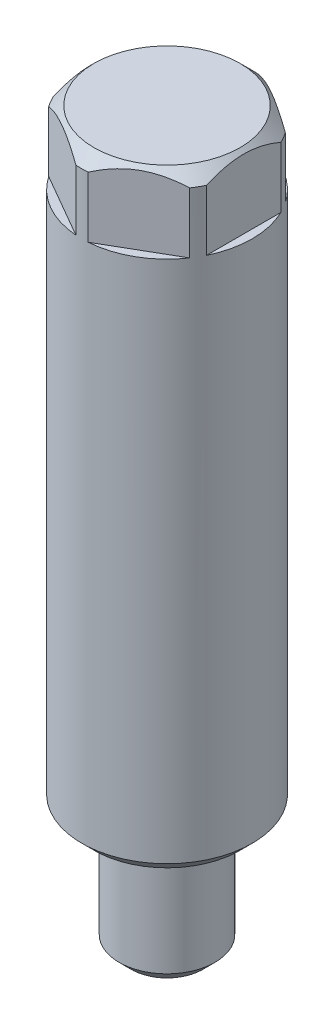
ISO-10303-21;
HEADER;
FILE_DESCRIPTION(('STEP AP214'),'2;1');
FILE_NAME('part.step','',(''),(''),'','','');
FILE_SCHEMA(('AUTOMOTIVE_DESIGN { 1 0 10303 214 1 1 1 1 }'));
ENDSEC;
DATA;
#1=APPLICATION_CONTEXT('core data for automotive mechanical design processes');
#2=APPLICATION_PROTOCOL_DEFINITION('international standard','automotive_design',2000,#1);
#3=PRODUCT_CONTEXT('',#1,'mechanical');
#4=PRODUCT('Part','Part','',(#3));
#5=PRODUCT_RELATED_PRODUCT_CATEGORY('part','',(#4));
#6=PRODUCT_DEFINITION_FORMATION('','',#4);
#7=PRODUCT_DEFINITION_CONTEXT('part definition',#1,'design');
#8=PRODUCT_DEFINITION('design','',#6,#7);
#9=PRODUCT_DEFINITION_SHAPE('','',#8);
#10=(LENGTH_UNIT() NAMED_UNIT(*) SI_UNIT(.MILLI.,.METRE.));
#11=(NAMED_UNIT(*) PLANE_ANGLE_UNIT() SI_UNIT($,.RADIAN.));
#12=(NAMED_UNIT(*) SI_UNIT($,.STERADIAN.) SOLID_ANGLE_UNIT());
#13=UNCERTAINTY_MEASURE_WITH_UNIT(LENGTH_MEASURE(1.E-05),#10,'distance_accuracy_value','');
#14=(GEOMETRIC_REPRESENTATION_CONTEXT(3) GLOBAL_UNCERTAINTY_ASSIGNED_CONTEXT((#13)) GLOBAL_UNIT_ASSIGNED_CONTEXT((#10,
#11,#12)) REPRESENTATION_CONTEXT('',''));
#15=CARTESIAN_POINT('',(0.,0.,0.));
#16=DIRECTION('',(0.,0.,1.));
#17=DIRECTION('',(1.,0.,0.));
#18=AXIS2_PLACEMENT_3D('',#15,#16,#17);
#19=CARTESIAN_POINT('',(0.,0.,0.));
#20=DIRECTION('',(0.,-1.,0.));
#21=DIRECTION('',(0.,0.,-1.));
#22=AXIS2_PLACEMENT_3D('',#19,#20,#21);
#23=CYLINDRICAL_SURFACE('',#22,4.445);
#24=CARTESIAN_POINT('',(-1.11022302462516E-13,6.98499999999991,0.));
#25=DIRECTION('',(0.,-1.,0.));
#26=DIRECTION('',(0.,0.,-1.));
#27=AXIS2_PLACEMENT_3D('',#24,#25,#26);
#28=CIRCLE('',#27,4.445);
#29=CARTESIAN_POINT('',(-1.07814590588617E-13,6.9849999999999,-4.44500000000006));
#30=VERTEX_POINT('',#29);
#31=EDGE_CURVE('E363',#30,#30,#28,.F.);
#32=ORIENTED_EDGE('',*,*,#31,.T.);
#33=EDGE_LOOP('',(#32));
#34=FACE_BOUND('',#33,.T.);
#35=CARTESIAN_POINT('',(-1.66533453693773E-13,34.3,-5.55111512312578E-13));
#36=DIRECTION('',(0.,1.,0.));
#37=DIRECTION('',(0.,0.,1.));
#38=AXIS2_PLACEMENT_3D('',#35,#36,#37);
#39=CIRCLE('',#38,4.445);
#40=CARTESIAN_POINT('',(-0.321155531325224,34.3,4.43338292105389));
#41=VERTEX_POINT('',#40);
#42=CARTESIAN_POINT('',(-3.67884446867528,34.3,2.49482030922016));
#43=VERTEX_POINT('',#42);
#44=EDGE_CURVE('E12',#41,#43,#39,.F.);
#45=ORIENTED_EDGE('',*,*,#44,.T.);
#46=DIRECTION('',(0.,-1.,0.));
#47=VECTOR('',#46,1.);
#48=CARTESIAN_POINT('',(-3.67884446867523,0.,2.49482030922038));
#49=LINE('',#48,#47);
#50=CARTESIAN_POINT('',(-3.67884446867539,37.465,2.49482030922022));
#51=VERTEX_POINT('',#50);
#52=EDGE_CURVE('E214',#43,#51,#49,.F.);
#53=ORIENTED_EDGE('',*,*,#52,.T.);
#54=CARTESIAN_POINT('',(-3.33066907387547E-13,37.465,-3.33066907387547E-13));
#55=DIRECTION('',(0.,1.,0.));
#56=DIRECTION('',(0.,0.,1.));
#57=AXIS2_PLACEMENT_3D('',#54,#55,#56);
#58=CIRCLE('',#57,4.445);
#59=CARTESIAN_POINT('',(-3.9999999999999,37.465,1.93856261183284));
#60=VERTEX_POINT('',#59);
#61=EDGE_CURVE('E301',#51,#60,#58,.F.);
#62=ORIENTED_EDGE('',*,*,#61,.T.);
#63=DIRECTION('',(0.,-1.,0.));
#64=VECTOR('',#63,1.);
#65=CARTESIAN_POINT('',(-4.00000000000017,0.,1.93856261183329));
#66=LINE('',#65,#64);
#67=CARTESIAN_POINT('',(-3.99999999999995,34.3,1.93856261183301));
#68=VERTEX_POINT('',#67);
#69=EDGE_CURVE('E293',#60,#68,#66,.T.);
#70=ORIENTED_EDGE('',*,*,#69,.T.);
#71=CARTESIAN_POINT('',(-3.99999999999973,34.3,-1.93856261183445));
#72=VERTEX_POINT('',#71);
#73=EDGE_CURVE('E28',#68,#72,#39,.F.);
#74=ORIENTED_EDGE('',*,*,#73,.T.);
#75=DIRECTION('',(0.,-1.,0.));
#76=VECTOR('',#75,1.);
#77=CARTESIAN_POINT('',(-3.99999999999984,0.,-1.9385626118345));
#78=LINE('',#77,#76);
#79=CARTESIAN_POINT('',(-4.00000000000039,37.465,-1.93856261183522));
#80=VERTEX_POINT('',#79);
#81=EDGE_CURVE('E295',#72,#80,#78,.F.);
#82=ORIENTED_EDGE('',*,*,#81,.T.);
#83=CARTESIAN_POINT('',(-3.678844468675,37.465,-2.49482030922143));
#84=VERTEX_POINT('',#83);
#85=EDGE_CURVE('E350',#80,#84,#58,.F.);
#86=ORIENTED_EDGE('',*,*,#85,.T.);
#87=DIRECTION('',(0.,-1.,0.));
#88=VECTOR('',#87,1.);
#89=CARTESIAN_POINT('',(-3.67884446867517,0.,-2.49482030922193));
#90=LINE('',#89,#88);
#91=CARTESIAN_POINT('',(-3.67884446867511,34.3,-2.49482030922193));
#92=VERTEX_POINT('',#91);
#93=EDGE_CURVE('E309',#84,#92,#90,.T.);
#94=ORIENTED_EDGE('',*,*,#93,.T.);
#95=CARTESIAN_POINT('',(-0.321155531325334,34.3,-4.43338292105478));
#96=VERTEX_POINT('',#95);
#97=EDGE_CURVE('E348',#92,#96,#39,.F.);
#98=ORIENTED_EDGE('',*,*,#97,.T.);
#99=DIRECTION('',(0.,-1.,0.));
#100=VECTOR('',#99,1.);
#101=CARTESIAN_POINT('',(-0.321155531325001,0.,-4.43338292105505));
#102=LINE('',#101,#100);
#103=CARTESIAN_POINT('',(-0.321155531325556,37.465,-4.43338292105494));
#104=VERTEX_POINT('',#103);
#105=EDGE_CURVE('E303',#96,#104,#102,.F.);
#106=ORIENTED_EDGE('',*,*,#105,.T.);
#107=CARTESIAN_POINT('',(0.321155531325001,37.465,-4.43338292105555));
#108=VERTEX_POINT('',#107);
#109=EDGE_CURVE('E355',#104,#108,#58,.F.);
#110=ORIENTED_EDGE('',*,*,#109,.T.);
#111=DIRECTION('',(0.,-1.,0.));
#112=VECTOR('',#111,1.);
#113=CARTESIAN_POINT('',(0.321155531324946,0.,-4.43338292105572));
#114=LINE('',#113,#112);
#115=CARTESIAN_POINT('',(0.321155531325112,34.3,-4.43338292105566));
#116=VERTEX_POINT('',#115);
#117=EDGE_CURVE('E332',#108,#116,#114,.T.);
#118=ORIENTED_EDGE('',*,*,#117,.T.);
#119=CARTESIAN_POINT('',(3.67884446867451,34.3,-2.49482030922138));
#120=VERTEX_POINT('',#119);
#121=EDGE_CURVE('E134',#116,#120,#39,.F.);
#122=ORIENTED_EDGE('',*,*,#121,.T.);
#123=DIRECTION('',(0.,-1.,0.));
#124=VECTOR('',#123,1.);
#125=CARTESIAN_POINT('',(3.67884446867467,0.,-2.49482030922105));
#126=LINE('',#125,#124);
#127=CARTESIAN_POINT('',(3.67884446867456,37.465,-2.49482030922099));
#128=VERTEX_POINT('',#127);
#129=EDGE_CURVE('E336',#120,#128,#126,.F.);
#130=ORIENTED_EDGE('',*,*,#129,.T.);
#131=CARTESIAN_POINT('',(3.99999999999961,37.465,-1.9385626118344));
#132=VERTEX_POINT('',#131);
#133=EDGE_CURVE('E371',#128,#132,#58,.F.);
#134=ORIENTED_EDGE('',*,*,#133,.T.);
#135=DIRECTION('',(0.,-1.,0.));
#136=VECTOR('',#135,1.);
#137=CARTESIAN_POINT('',(4.00000000000012,0.,-1.93856261183467));
#138=LINE('',#137,#136);
#139=CARTESIAN_POINT('',(3.99999999999973,34.3,-1.93856261183434));
#140=VERTEX_POINT('',#139);
#141=EDGE_CURVE('E43',#132,#140,#138,.T.);
#142=ORIENTED_EDGE('',*,*,#141,.T.);
#143=CARTESIAN_POINT('',(3.99999999999995,34.3,1.93856261183367));
#144=VERTEX_POINT('',#143);
#145=EDGE_CURVE('E128',#140,#144,#39,.F.);
#146=ORIENTED_EDGE('',*,*,#145,.T.);
#147=DIRECTION('',(0.,-1.,0.));
#148=VECTOR('',#147,1.);
#149=CARTESIAN_POINT('',(4.00000000000017,0.,1.93856261183306));
#150=LINE('',#149,#148);
#151=CARTESIAN_POINT('',(4.00000000000017,37.465,1.93856261183289));
#152=VERTEX_POINT('',#151);
#153=EDGE_CURVE('E328',#144,#152,#150,.F.);
#154=ORIENTED_EDGE('',*,*,#153,.T.);
#155=CARTESIAN_POINT('',(3.67884446867467,37.465,2.49482030922044));
#156=VERTEX_POINT('',#155);
#157=EDGE_CURVE('E374',#152,#156,#58,.F.);
#158=ORIENTED_EDGE('',*,*,#157,.T.);
#159=DIRECTION('',(0.,-1.,0.));
#160=VECTOR('',#159,1.);
#161=CARTESIAN_POINT('',(3.67884446867444,0.,2.49482030922016));
#162=LINE('',#161,#160);
#163=CARTESIAN_POINT('',(3.67884446867439,34.3,2.49482030922044));
#164=VERTEX_POINT('',#163);
#165=EDGE_CURVE('E35',#156,#164,#162,.T.);
#166=ORIENTED_EDGE('',*,*,#165,.T.);
#167=CARTESIAN_POINT('',(0.321155531325057,34.3,4.43338292105433));
#168=VERTEX_POINT('',#167);
#169=EDGE_CURVE('E23',#164,#168,#39,.F.);
#170=ORIENTED_EDGE('',*,*,#169,.T.);
#171=DIRECTION('',(0.,-1.,0.));
#172=VECTOR('',#171,1.);
#173=CARTESIAN_POINT('',(0.321155531325168,0.,4.43338292105411));
#174=LINE('',#173,#172);
#175=CARTESIAN_POINT('',(0.321155531324946,37.465,4.43338292105422));
#176=VERTEX_POINT('',#175);
#177=EDGE_CURVE('E109',#168,#176,#174,.F.);
#178=ORIENTED_EDGE('',*,*,#177,.T.);
#179=CARTESIAN_POINT('',(-0.321155531325723,37.465,4.43338292105427));
#180=VERTEX_POINT('',#179);
#181=EDGE_CURVE('E314',#176,#180,#58,.F.);
#182=ORIENTED_EDGE('',*,*,#181,.T.);
#183=DIRECTION('',(0.,-1.,0.));
#184=VECTOR('',#183,1.);
#185=CARTESIAN_POINT('',(-0.321155531325001,0.,4.43338292105389));
#186=LINE('',#185,#184);
#187=EDGE_CURVE('E221',#180,#41,#186,.T.);
#188=ORIENTED_EDGE('',*,*,#187,.T.);
#189=EDGE_LOOP('',(#45,#53,#62,#70,#74,#82,#86,#94,#98,#106,#110,#118,#122,#130,#134,#142,#146,
#154,#158,#166,#170,#178,#182,#188));
#190=FACE_BOUND('',#189,.T.);
#191=ADVANCED_FACE('F19',(#34,#190),#23,.T.);
#192=CARTESIAN_POINT('',(-3.33066907387547E-13,37.465,-3.33066907387547E-13));
#193=DIRECTION('',(0.,-1.,0.));
#194=DIRECTION('',(0.,0.,-1.));
#195=AXIS2_PLACEMENT_3D('',#192,#193,#194);
#196=CONICAL_SURFACE('',#195,4.445,0.785398163397445);
#197=CARTESIAN_POINT('',(-2.77555756156289E-13,38.1,-6.10622663543836E-13));
#198=DIRECTION('',(0.,1.,0.));
#199=DIRECTION('',(0.,0.,1.));
#200=AXIS2_PLACEMENT_3D('',#197,#198,#199);
#201=CIRCLE('',#200,3.81);
#202=CARTESIAN_POINT('',(-2.80305223476773E-13,38.1,3.80999999999939));
#203=VERTEX_POINT('',#202);
#204=EDGE_CURVE('E360',#203,#203,#201,.T.);
#205=ORIENTED_EDGE('',*,*,#204,.F.);
#206=EDGE_LOOP('',(#205));
#207=FACE_BOUND('',#206,.T.);
#208=ORIENTED_EDGE('',*,*,#61,.F.);
#209=CARTESIAN_POINT('',(-3.67924157880906,37.4648,2.49459103757748));
#210=CARTESIAN_POINT('',(-3.55842668008898,37.5256475819524,2.56434355187511));
#211=CARTESIAN_POINT('',(-3.43577687510053,37.5821161939123,2.63515544980108));
#212=CARTESIAN_POINT('',(-3.18661058206892,37.6839828819882,2.77901167615578));
#213=CARTESIAN_POINT('',(-3.0600818676109,37.7293407721551,2.85206306350842));
#214=CARTESIAN_POINT('',(-2.80525749768695,37.8057743284289,2.99918598208));
#215=CARTESIAN_POINT('',(-2.67699738347415,37.8370039187697,3.07323699354689));
#216=CARTESIAN_POINT('',(-2.41847964602117,37.8836076436892,3.22249227885608));
#217=CARTESIAN_POINT('',(-2.28822526184028,37.8990051879054,3.29769468262663));
#218=CARTESIAN_POINT('',(-2.03526080562799,37.9122848524362,3.44374377951615));
#219=CARTESIAN_POINT('',(-1.91259198073002,37.9112085566851,3.5145666585916));
#220=CARTESIAN_POINT('',(-1.66798704258085,37.8941453545516,3.65578938547678));
#221=CARTESIAN_POINT('',(-1.54605133144097,37.8781509045181,3.72618900112743));
#222=CARTESIAN_POINT('',(-1.30421211468979,37.8324394041874,3.86581493801925));
#223=CARTESIAN_POINT('',(-1.18430791647583,37.8027271324349,3.93504165913475));
#224=CARTESIAN_POINT('',(-0.947174486107135,37.7314328980728,4.07195070899265));
#225=CARTESIAN_POINT('',(-0.829946095289468,37.6898472562366,4.13963255198886));
#226=CARTESIAN_POINT('',(-0.647561004669942,37.6165664014648,4.2449326331538));
#227=CARTESIAN_POINT('',(-0.581391396404496,37.588148727599,4.28313567429746));
#228=CARTESIAN_POINT('',(-0.450242196575703,37.5285033306455,4.35885470012198));
#229=CARTESIAN_POINT('',(-0.385259568943978,37.497284526477,4.39637243767773));
#230=CARTESIAN_POINT('',(-0.32075842119128,37.4648,4.43361219269661));
#231=B_SPLINE_CURVE_WITH_KNOTS('',3,(#209,#210,#211,#212,#213,#214,#215,#216,#217,#218,#219,
#220,#221,#222,#223,#224,#225,#226,#227,#228,#229,#230),.UNSPECIFIED.,.F.,.F.,(4,2,2,2,2,2,2,2,
2,2,4),(0.,0.456806526364886,0.915241640320476,1.36855427044122,1.82119565368307,
2.24534314890753,2.66970523880162,3.09391961537831,3.51826558710297,3.76277283649077,
4.0065274633879),.UNSPECIFIED.);
#232=EDGE_CURVE('E129',#51,#180,#231,.T.);
#233=ORIENTED_EDGE('',*,*,#232,.T.);
#234=ORIENTED_EDGE('',*,*,#181,.F.);
#235=CARTESIAN_POINT('',(0.320758421190947,37.4648,4.43361219269672));
#236=CARTESIAN_POINT('',(0.441573319910949,37.5256475819519,4.36385967839879));
#237=CARTESIAN_POINT('',(0.564223124899364,37.5821161939118,4.29304778047272));
#238=CARTESIAN_POINT('',(0.813389417930992,37.6839828819876,4.14919155411795));
#239=CARTESIAN_POINT('',(0.939918132389067,37.7293407721545,4.07614016676534));
#240=CARTESIAN_POINT('',(1.1947425023131,37.8057743284282,3.92901724819365));
#241=CARTESIAN_POINT('',(1.32300261652594,37.8370039187689,3.85496623672664));
#242=CARTESIAN_POINT('',(1.58152035397909,37.8836076436887,3.70571095141762));
#243=CARTESIAN_POINT('',(1.71177473816012,37.8990051879054,3.63050854764737));
#244=CARTESIAN_POINT('',(1.96473919437235,37.9122848524361,3.48445945075785));
#245=CARTESIAN_POINT('',(2.08740801927012,37.9112085566844,3.41363657168215));
#246=CARTESIAN_POINT('',(2.33201295741919,37.8941453545505,3.2724138447968));
#247=CARTESIAN_POINT('',(2.45394866855917,37.8781509045172,3.20201422914623));
#248=CARTESIAN_POINT('',(2.69578788531027,37.8324394041864,3.06238829225439));
#249=CARTESIAN_POINT('',(2.81569208352406,37.8027271324336,2.99316157113877));
#250=CARTESIAN_POINT('',(3.05282551389312,37.7314328980721,2.85625252128117));
#251=CARTESIAN_POINT('',(3.17005390471131,37.6898472562369,2.78857067828537));
#252=CARTESIAN_POINT('',(3.35243899533039,37.6165664014647,2.68327059712037));
#253=CARTESIAN_POINT('',(3.41860860359535,37.5881487275984,2.64506755597656));
#254=CARTESIAN_POINT('',(3.54975780342355,37.5285033306445,2.56934853015194));
#255=CARTESIAN_POINT('',(3.61474043105516,37.497284526476,2.53183079259623));
#256=CARTESIAN_POINT('',(3.67924157880834,37.4648,2.49459103757776));
#257=B_SPLINE_CURVE_WITH_KNOTS('',3,(#235,#236,#237,#238,#239,#240,#241,#242,#243,#244,#245,
#246,#247,#248,#249,#250,#251,#252,#253,#254,#255,#256),.UNSPECIFIED.,.F.,.F.,(4,2,2,2,2,2,2,2,
2,2,4),(0.,0.456806526364733,0.915241640320467,1.36855427044142,1.82119565368331,
2.24534314890765,2.6697052388018,3.09391961537848,3.518265587103,3.76277283649034,
4.00652746338704),.UNSPECIFIED.);
#258=EDGE_CURVE('E113',#176,#156,#257,.T.);
#259=ORIENTED_EDGE('',*,*,#258,.T.);
#260=ORIENTED_EDGE('',*,*,#157,.F.);
#261=CARTESIAN_POINT('',(4.00000000000022,35.758130470376,-4.67391684880308));
#262=CARTESIAN_POINT('',(3.99999999999969,35.8443456942503,-4.56041354774168));
#263=CARTESIAN_POINT('',(3.99999999999947,35.9297476742269,-4.44628241733308));
#264=CARTESIAN_POINT('',(3.99999999999931,36.0985586174467,-4.21651392996503));
#265=CARTESIAN_POINT('',(3.99999999999937,36.1819670846352,-4.10087620895002));
#266=CARTESIAN_POINT('',(3.99999999999941,36.347017940246,-3.86699799772407));
#267=CARTESIAN_POINT('',(3.9999999999994,36.4286416611714,-3.74874428932665));
#268=CARTESIAN_POINT('',(3.99999999999939,36.5889105568525,-3.51024173377978));
#269=CARTESIAN_POINT('',(3.99999999999939,36.6675559401949,-3.3899930272006));
#270=CARTESIAN_POINT('',(3.99999999999939,36.8257435566655,-3.13999738692947));
#271=CARTESIAN_POINT('',(3.99999999999938,36.90506380849,-3.01010927777554));
#272=CARTESIAN_POINT('',(3.9999999999994,37.0585831176381,-2.74729429663522));
#273=CARTESIAN_POINT('',(3.99999999999943,37.1327813473136,-2.61436693814615));
#274=CARTESIAN_POINT('',(3.99999999999935,37.2744622234466,-2.3454701266144));
#275=CARTESIAN_POINT('',(3.99999999999925,37.3419646125748,-2.20951115799648));
#276=CARTESIAN_POINT('',(3.99999999999953,37.4687421642559,-1.93384067233958));
#277=CARTESIAN_POINT('',(3.99999999999992,37.5280211030445,-1.7941309130889));
#278=CARTESIAN_POINT('',(3.99999999999987,37.6315471815475,-1.52297748977935));
#279=CARTESIAN_POINT('',(3.99999999999951,37.6766510887059,-1.39186434054456));
#280=CARTESIAN_POINT('',(3.99999999999927,37.7563491126691,-1.12642190871188));
#281=CARTESIAN_POINT('',(3.9999999999994,37.7909425240761,-0.992092410905475));
#282=CARTESIAN_POINT('',(3.99999999999938,37.8472166619945,-0.723286768512063));
#283=CARTESIAN_POINT('',(3.99999999999925,37.8691228347054,-0.58885861069329));
#284=CARTESIAN_POINT('',(3.99999999999953,37.8995864837885,-0.318490080047614));
#285=CARTESIAN_POINT('',(3.99999999999996,37.9081463994936,-0.182549988136654));
#286=CARTESIAN_POINT('',(3.99999999999994,37.9112514158807,0.0842533899229561));
#287=CARTESIAN_POINT('',(3.99999999999953,37.9063232430706,0.215110698811373));
#288=CARTESIAN_POINT('',(3.99999999999925,37.8839027239278,0.475737347582689));
#289=CARTESIAN_POINT('',(3.99999999999938,37.8664091808294,0.605506582642864));
#290=CARTESIAN_POINT('',(3.9999999999994,37.8195259667422,0.865213175723362));
#291=CARTESIAN_POINT('',(3.99999999999928,37.7899314516751,0.995112947003596));
#292=CARTESIAN_POINT('',(3.99999999999949,37.7204448649146,1.25207324199553));
#293=CARTESIAN_POINT('',(3.99999999999982,37.6805535683695,1.37913397864959));
#294=CARTESIAN_POINT('',(3.99999999999985,37.5885693859732,1.64040097415722));
#295=CARTESIAN_POINT('',(3.99999999999951,37.5357480647939,1.77434805933812));
#296=CARTESIAN_POINT('',(3.99999999999926,37.4219773983793,2.03877532915735));
#297=CARTESIAN_POINT('',(3.99999999999936,37.3610243086421,2.16925388321785));
#298=CARTESIAN_POINT('',(3.99999999999942,37.232438483361,2.42737411792324));
#299=CARTESIAN_POINT('',(3.9999999999994,37.1647849090994,2.5550053330583));
#300=CARTESIAN_POINT('',(3.99999999999938,37.0242911743795,2.80733515288008));
#301=CARTESIAN_POINT('',(3.99999999999939,36.9514518295907,2.93203421467846));
#302=CARTESIAN_POINT('',(3.99999999999939,36.8053213801128,3.17276369559882));
#303=CARTESIAN_POINT('',(3.99999999999939,36.7322320216332,3.28891723103115));
#304=CARTESIAN_POINT('',(3.99999999999939,36.5829660547145,3.51922961347799));
#305=CARTESIAN_POINT('',(3.9999999999994,36.5067892132136,3.63338830897549));
#306=CARTESIAN_POINT('',(3.99999999999938,36.3525257325269,3.85904901804164));
#307=CARTESIAN_POINT('',(3.99999999999936,36.274459530761,3.97056505309079));
#308=CARTESIAN_POINT('',(3.99999999999942,36.116252366992,4.19207095310085));
#309=CARTESIAN_POINT('',(3.99999999999949,36.0361119820476,4.30206122973742));
#310=CARTESIAN_POINT('',(3.99999999999967,35.95512321585,4.41141219049029));
#311=B_SPLINE_CURVE_WITH_KNOTS('',3,(#261,#262,#263,#264,#265,#266,#267,#268,#269,#270,#271,
#272,#273,#274,#275,#276,#277,#278,#279,#280,#281,#282,#283,#284,#285,#286,#287,#288,#289,#290,
#291,#292,#293,#294,#295,#296,#297,#298,#299,#300,#301,#302,#303,#304,#305,#306,#307,#308,#309,
#310),.UNSPECIFIED.,.F.,.F.,(4,2,2,2,2,2,2,2,2,2,2,2,2,2,2,2,2,2,2,2,2,2,2,2,4),(0.,
0.427611554035311,0.855328427493845,1.28635600389762,1.71735333742733,2.17383757941247,
2.63039541112152,3.08556435896379,3.54052359489737,3.95612345897401,4.3717512093195,
4.7797469494646,5.18766811033748,5.57988906919655,5.97214738938067,6.37134044400533,
6.77050345587829,7.20212646898267,7.63394892552403,8.06715925730394,8.50030159935603,
8.91195204449802,9.32363362160571,9.73198449469129,10.1402229563502),.UNSPECIFIED.);
#312=EDGE_CURVE('E260',#152,#132,#311,.F.);
#313=ORIENTED_EDGE('',*,*,#312,.T.);
#314=ORIENTED_EDGE('',*,*,#133,.F.);
#315=CARTESIAN_POINT('',(3.6792415788085,37.4648,-2.4945910375786));
#316=CARTESIAN_POINT('',(3.55842668008854,37.5256475819517,-2.56434355187679));
#317=CARTESIAN_POINT('',(3.43577687510014,37.5821161939114,-2.63515544980293));
#318=CARTESIAN_POINT('',(3.18661058206848,37.6839828819872,-2.77901167615775));
#319=CARTESIAN_POINT('',(3.06008186761036,37.7293407721542,-2.85206306351035));
#320=CARTESIAN_POINT('',(2.80525749768632,37.8057743284278,-2.99918598208208));
#321=CARTESIAN_POINT('',(2.67699738347353,37.8370039187684,-3.07323699354916));
#322=CARTESIAN_POINT('',(2.41847964602033,37.8836076436885,-3.22249227885798));
#323=CARTESIAN_POINT('',(2.28822526183922,37.8990051879055,-3.29769468262796));
#324=CARTESIAN_POINT('',(2.03526080562709,37.9122848524362,-3.44374377951745));
#325=CARTESIAN_POINT('',(1.91259198072948,37.9112085566842,-3.51456665859337));
#326=CARTESIAN_POINT('',(1.66798704258053,37.8941453545501,-3.65578938547884));
#327=CARTESIAN_POINT('',(1.54605133144051,37.8781509045169,-3.72618900112932));
#328=CARTESIAN_POINT('',(1.30421211468943,37.8324394041861,-3.86581493802117));
#329=CARTESIAN_POINT('',(1.18430791647572,37.8027271324333,-3.93504165913687));
#330=CARTESIAN_POINT('',(0.947174486106522,37.731432898072,-4.07195070899429));
#331=CARTESIAN_POINT('',(0.829946095288118,37.6898472562369,-4.13963255198983));
#332=CARTESIAN_POINT('',(0.647561004669085,37.6165664014646,-4.24493263315498));
#333=CARTESIAN_POINT('',(0.581391396404179,37.5881487275982,-4.28313567429898));
#334=CARTESIAN_POINT('',(0.450242196575949,37.5285033306442,-4.35885470012384));
#335=CARTESIAN_POINT('',(0.385259568944248,37.4972845264757,-4.3963724376796));
#336=CARTESIAN_POINT('',(0.320758421190725,37.4648,-4.43361219269789));
#337=B_SPLINE_CURVE_WITH_KNOTS('',3,(#315,#316,#317,#318,#319,#320,#321,#322,#323,#324,#325,
#326,#327,#328,#329,#330,#331,#332,#333,#334,#335,#336),.UNSPECIFIED.,.F.,.F.,(4,2,2,2,2,2,2,2,
2,2,4),(0.,0.456806526364706,0.915241640320565,1.36855427044148,1.82119565368326,
2.24534314890749,2.6697052388016,3.09391961537826,3.51826558710275,3.76277283649035,
4.0065274633873),.UNSPECIFIED.);
#338=EDGE_CURVE('E250',#128,#108,#337,.T.);
#339=ORIENTED_EDGE('',*,*,#338,.T.);
#340=ORIENTED_EDGE('',*,*,#109,.F.);
#341=CARTESIAN_POINT('',(-0.320758421191669,37.4648,-4.43361219269828));
#342=CARTESIAN_POINT('',(-0.44157331991163,37.5256475819516,-4.36385967840011));
#343=CARTESIAN_POINT('',(-0.564223124900001,37.5821161939113,-4.29304778047396));
#344=CARTESIAN_POINT('',(-0.813389417931583,37.683982881987,-4.14919155411914));
#345=CARTESIAN_POINT('',(-0.939918132389658,37.729340772154,-4.07614016676655));
#346=CARTESIAN_POINT('',(-1.1947425023137,37.8057743284276,-3.92901724819489));
#347=CARTESIAN_POINT('',(-1.32300261652654,37.8370039187682,-3.85496623672787));
#348=CARTESIAN_POINT('',(-1.58152035397964,37.8836076436883,-3.70571095141886));
#349=CARTESIAN_POINT('',(-1.7117747381606,37.8990051879054,-3.63050854764863));
#350=CARTESIAN_POINT('',(-1.96473919437276,37.9122848524361,-3.48445945075915));
#351=CARTESIAN_POINT('',(-2.08740801927053,37.9112085566841,-3.41363657168347));
#352=CARTESIAN_POINT('',(-2.3320129574196,37.8941453545501,-3.27241384479814));
#353=CARTESIAN_POINT('',(-2.45394866855959,37.8781509045168,-3.20201422914757));
#354=CARTESIAN_POINT('',(-2.69578788531067,37.8324394041861,-3.06238829225572));
#355=CARTESIAN_POINT('',(-2.81569208352443,37.8027271324332,-2.99316157114011));
#356=CARTESIAN_POINT('',(-3.05282551389356,37.731432898072,-2.8562525212825));
#357=CARTESIAN_POINT('',(-3.17005390471185,37.689847256237,-2.78857067828668));
#358=CARTESIAN_POINT('',(-3.35243899533089,37.6165664014647,-2.6832705971217));
#359=CARTESIAN_POINT('',(-3.41860860359582,37.5881487275983,-2.6450675559779));
#360=CARTESIAN_POINT('',(-3.54975780342398,37.5285033306442,-2.56934853015321));
#361=CARTESIAN_POINT('',(-3.61474043105558,37.4972845264757,-2.53183079259744));
#362=CARTESIAN_POINT('',(-3.67924157880884,37.4648,-2.49459103757882));
#363=B_SPLINE_CURVE_WITH_KNOTS('',3,(#341,#342,#343,#344,#345,#346,#347,#348,#349,#350,#351,
#352,#353,#354,#355,#356,#357,#358,#359,#360,#361,#362),.UNSPECIFIED.,.F.,.F.,(4,2,2,2,2,2,2,2,
2,2,4),(0.,0.456806526364584,0.915241640320335,1.36855427044128,1.82119565368307,
2.24534314890734,2.6697052388015,3.09391961537817,3.51826558710265,3.76277283649007,
4.00652746338684),.UNSPECIFIED.);
#364=EDGE_CURVE('E141',#104,#84,#363,.T.);
#365=ORIENTED_EDGE('',*,*,#364,.T.);
#366=ORIENTED_EDGE('',*,*,#85,.F.);
#367=CARTESIAN_POINT('',(-4.00000000000045,35.7581304703761,-4.67391684880342));
#368=CARTESIAN_POINT('',(-4.00000000000059,35.84434569425,-4.56041354774183));
#369=CARTESIAN_POINT('',(-4.00000000000065,35.9297476742265,-4.44628241733316));
#370=CARTESIAN_POINT('',(-4.00000000000069,36.0985586174462,-4.21651392996509));
#371=CARTESIAN_POINT('',(-4.00000000000068,36.1819670846347,-4.10087620895012));
#372=CARTESIAN_POINT('',(-4.00000000000066,36.3470179402455,-3.86699799772419));
#373=CARTESIAN_POINT('',(-4.00000000000067,36.4286416611709,-3.74874428932674));
#374=CARTESIAN_POINT('',(-4.00000000000067,36.588910556852,-3.51024173377983));
#375=CARTESIAN_POINT('',(-4.00000000000067,36.6675559401944,-3.38999302720065));
#376=CARTESIAN_POINT('',(-4.00000000000067,36.825743556665,-3.13999738692951));
#377=CARTESIAN_POINT('',(-4.00000000000068,36.9050638084895,-3.01010927777558));
#378=CARTESIAN_POINT('',(-4.00000000000066,37.0585831176376,-2.74729429663525));
#379=CARTESIAN_POINT('',(-4.00000000000064,37.1327813473131,-2.61436693814618));
#380=CARTESIAN_POINT('',(-4.0000000000007,37.274462223446,-2.3454701266144));
#381=CARTESIAN_POINT('',(-4.00000000000078,37.3419646125741,-2.20951115799645));
#382=CARTESIAN_POINT('',(-4.00000000000056,37.4687421642555,-1.93384067233973));
#383=CARTESIAN_POINT('',(-4.00000000000026,37.5280211030445,-1.79413091308925));
#384=CARTESIAN_POINT('',(-4.0000000000003,37.6315471815475,-1.52297748977974));
#385=CARTESIAN_POINT('',(-4.00000000000058,37.6766510887054,-1.39186434054479));
#386=CARTESIAN_POINT('',(-4.00000000000076,37.7563491126684,-1.12642190871196));
#387=CARTESIAN_POINT('',(-4.00000000000065,37.7909425240755,-0.99209241090557));
#388=CARTESIAN_POINT('',(-4.00000000000069,37.8472166619939,-0.723286768512121));
#389=CARTESIAN_POINT('',(-4.00000000000083,37.8691228347046,-0.588858610693304));
#390=CARTESIAN_POINT('',(-4.00000000000051,37.899586483788,-0.318490080047595));
#391=CARTESIAN_POINT('',(-4.00000000000005,37.9081463994935,-0.182549988136647));
#392=CARTESIAN_POINT('',(-4.00000000000007,37.9112514158806,0.0842533899228906));
#393=CARTESIAN_POINT('',(-4.00000000000051,37.9063232430701,0.215110698811247));
#394=CARTESIAN_POINT('',(-4.00000000000084,37.8839027239271,0.475737347582478));
#395=CARTESIAN_POINT('',(-4.00000000000072,37.8664091808288,0.605506582642629));
#396=CARTESIAN_POINT('',(-4.00000000000063,37.8195259667417,0.865213175723056));
#397=CARTESIAN_POINT('',(-4.00000000000066,37.7899314516746,0.995112947003244));
#398=CARTESIAN_POINT('',(-4.00000000000069,37.7204448649142,1.25207324199516));
#399=CARTESIAN_POINT('',(-4.00000000000067,37.6805535683694,1.37913397864924));
#400=CARTESIAN_POINT('',(-4.00000000000067,37.5885693859731,1.64040097415682));
#401=CARTESIAN_POINT('',(-4.00000000000067,37.5357480647937,1.77434805933764));
#402=CARTESIAN_POINT('',(-4.00000000000068,37.4219773983789,2.03877532915681));
#403=CARTESIAN_POINT('',(-4.00000000000068,37.3610243086418,2.16925388321734));
#404=CARTESIAN_POINT('',(-4.00000000000067,37.2324384833607,2.42737411792277));
#405=CARTESIAN_POINT('',(-4.00000000000067,37.1647849090992,2.55500533305785));
#406=CARTESIAN_POINT('',(-4.00000000000067,37.0242911743792,2.80733515287967));
#407=CARTESIAN_POINT('',(-4.00000000000067,36.9514518295904,2.93203421467806));
#408=CARTESIAN_POINT('',(-4.00000000000067,36.8053213801125,3.17276369559846));
#409=CARTESIAN_POINT('',(-4.00000000000068,36.7322320216329,3.28891723103081));
#410=CARTESIAN_POINT('',(-4.00000000000067,36.5829660547143,3.5192296134777));
#411=CARTESIAN_POINT('',(-4.00000000000067,36.5067892132133,3.63338830897523));
#412=CARTESIAN_POINT('',(-4.00000000000068,36.3525257325266,3.85904901804139));
#413=CARTESIAN_POINT('',(-4.00000000000069,36.2744595307608,3.97056505309051));
#414=CARTESIAN_POINT('',(-4.00000000000065,36.1162523669918,4.1920709531006));
#415=CARTESIAN_POINT('',(-4.00000000000059,36.0361119820475,4.30206122973723));
#416=CARTESIAN_POINT('',(-4.00000000000045,35.9551232158501,4.41141219049024));
#417=B_SPLINE_CURVE_WITH_KNOTS('',3,(#367,#368,#369,#370,#371,#372,#373,#374,#375,#376,#377,
#378,#379,#380,#381,#382,#383,#384,#385,#386,#387,#388,#389,#390,#391,#392,#393,#394,#395,#396,
#397,#398,#399,#400,#401,#402,#403,#404,#405,#406,#407,#408,#409,#410,#411,#412,#413,#414,#415,
#416),.UNSPECIFIED.,.F.,.F.,(4,2,2,2,2,2,2,2,2,2,2,2,2,2,2,2,2,2,2,2,2,2,2,2,4),(0.,
0.427611554035217,0.855328427493677,1.28635600389751,1.71735333742724,2.17383757941238,
2.63039541112146,3.08556435896366,3.54052359489712,3.95612345897379,4.37175120931938,
4.77974694946456,5.18766811033746,5.57988906919637,5.9721473893804,6.37134044400496,
6.77050345587777,7.20212646898212,7.63394892552347,8.06715925730344,8.50030159935557,
8.91195204449761,9.32363362160537,9.73198449469091,10.1402229563498),.UNSPECIFIED.);
#418=EDGE_CURVE('E136',#80,#60,#417,.T.);
#419=ORIENTED_EDGE('',*,*,#418,.T.);
#420=EDGE_LOOP('',(#208,#233,#234,#259,#260,#313,#314,#339,#340,#365,#366,#419));
#421=FACE_BOUND('',#420,.T.);
#422=ADVANCED_FACE('F157',(#207,#421),#196,.T.);
#423=CARTESIAN_POINT('',(0.,0.,0.));
#424=DIRECTION('',(0.,-1.,0.));
#425=DIRECTION('',(0.,0.,-1.));
#426=AXIS2_PLACEMENT_3D('',#423,#424,#425);
#427=PLANE('',#426);
#428=CARTESIAN_POINT('',(0.,0.,0.));
#429=DIRECTION('',(0.,-1.,0.));
#430=DIRECTION('',(0.,0.,-1.));
#431=AXIS2_PLACEMENT_3D('',#428,#429,#430);
#432=CIRCLE('',#431,1.8669);
#433=CARTESIAN_POINT('',(0.,0.,-1.8669));
#434=VERTEX_POINT('',#433);
#435=EDGE_CURVE('E213',#434,#434,#432,.T.);
#436=ORIENTED_EDGE('',*,*,#435,.T.);
#437=EDGE_LOOP('',(#436));
#438=FACE_BOUND('',#437,.T.);
#439=ADVANCED_FACE('F21',(#438),#427,.T.);
#440=CARTESIAN_POINT('',(0.,0.,0.));
#441=DIRECTION('',(0.,-1.,0.));
#442=DIRECTION('',(0.,0.,-1.));
#443=AXIS2_PLACEMENT_3D('',#440,#441,#442);
#444=CYLINDRICAL_SURFACE('',#443,2.5019);
#445=CARTESIAN_POINT('',(1.66533453693773E-13,0.634999999999941,-2.22044604925032E-13));
#446=DIRECTION('',(0.,-1.,0.));
#447=DIRECTION('',(0.,0.,-1.));
#448=AXIS2_PLACEMENT_3D('',#445,#446,#447);
#449=CIRCLE('',#448,2.5019);
#450=CARTESIAN_POINT('',(1.68338937234225E-13,0.634999999999938,-2.50190000000022));
#451=VERTEX_POINT('',#450);
#452=EDGE_CURVE('E207',#451,#451,#449,.F.);
#453=ORIENTED_EDGE('',*,*,#452,.T.);
#454=EDGE_LOOP('',(#453));
#455=FACE_BOUND('',#454,.T.);
#456=CARTESIAN_POINT('',(0.,6.35,-4.9960036108132E-13));
#457=DIRECTION('',(0.,-1.,0.));
#458=DIRECTION('',(0.,0.,-1.));
#459=AXIS2_PLACEMENT_3D('',#456,#457,#458);
#460=CIRCLE('',#459,2.5019);
#461=CARTESIAN_POINT('',(0.,6.35,-2.5019000000005));
#462=VERTEX_POINT('',#461);
#463=EDGE_CURVE('E210',#462,#462,#460,.T.);
#464=ORIENTED_EDGE('',*,*,#463,.T.);
#465=EDGE_LOOP('',(#464));
#466=FACE_BOUND('',#465,.T.);
#467=ADVANCED_FACE('F197',(#455,#466),#444,.T.);
#468=CARTESIAN_POINT('',(2.50190000000012,6.35,-6.10622663543836E-13));
#469=DIRECTION('',(0.,-1.,0.));
#470=DIRECTION('',(0.,0.,-1.));
#471=AXIS2_PLACEMENT_3D('',#468,#469,#470);
#472=PLANE('',#471);
#473=CARTESIAN_POINT('',(0.,6.35,-4.9960036108132E-13));
#474=DIRECTION('',(0.,-1.,0.));
#475=DIRECTION('',(0.,0.,-1.));
#476=AXIS2_PLACEMENT_3D('',#473,#474,#475);
#477=CIRCLE('',#476,3.81);
#478=CARTESIAN_POINT('',(0.,6.35,-3.8100000000005));
#479=VERTEX_POINT('',#478);
#480=EDGE_CURVE('E377',#479,#479,#477,.T.);
#481=ORIENTED_EDGE('',*,*,#480,.T.);
#482=EDGE_LOOP('',(#481));
#483=FACE_BOUND('',#482,.T.);
#484=ORIENTED_EDGE('',*,*,#463,.F.);
#485=EDGE_LOOP('',(#484));
#486=FACE_BOUND('',#485,.T.);
#487=ADVANCED_FACE('F195',(#483,#486),#472,.T.);
#488=CARTESIAN_POINT('',(4.44499999999976,38.1,-4.9960036108132E-13));
#489=DIRECTION('',(0.,1.,0.));
#490=DIRECTION('',(0.,0.,1.));
#491=AXIS2_PLACEMENT_3D('',#488,#489,#490);
#492=PLANE('',#491);
#493=ORIENTED_EDGE('',*,*,#204,.T.);
#494=EDGE_LOOP('',(#493));
#495=FACE_BOUND('',#494,.T.);
#496=ADVANCED_FACE('F193',(#495),#492,.T.);
#497=CARTESIAN_POINT('',(0.,0.,0.));
#498=DIRECTION('',(0.,1.,0.));
#499=DIRECTION('',(0.,0.,1.));
#500=AXIS2_PLACEMENT_3D('',#497,#498,#499);
#501=CONICAL_SURFACE('',#500,1.8669,0.785398163397446);
#502=ORIENTED_EDGE('',*,*,#452,.F.);
#503=EDGE_LOOP('',(#502));
#504=FACE_BOUND('',#503,.T.);
#505=ORIENTED_EDGE('',*,*,#435,.F.);
#506=EDGE_LOOP('',(#505));
#507=FACE_BOUND('',#506,.T.);
#508=ADVANCED_FACE('F391',(#504,#507),#501,.T.);
#509=CARTESIAN_POINT('',(0.,6.35,-4.9960036108132E-13));
#510=DIRECTION('',(0.,1.,0.));
#511=DIRECTION('',(0.,0.,1.));
#512=AXIS2_PLACEMENT_3D('',#509,#510,#511);
#513=CONICAL_SURFACE('',#512,3.81,0.785398163397445);
#514=ORIENTED_EDGE('',*,*,#31,.F.);
#515=EDGE_LOOP('',(#514));
#516=FACE_BOUND('',#515,.T.);
#517=ORIENTED_EDGE('',*,*,#480,.F.);
#518=EDGE_LOOP('',(#517));
#519=FACE_BOUND('',#518,.T.);
#520=ADVANCED_FACE('F176',(#516,#519),#513,.T.);
#521=CARTESIAN_POINT('',(3.99999999999978,34.3,2.30940107675804));
#522=DIRECTION('',(0.5,0.,0.866025403784445));
#523=DIRECTION('',(0.866025403784444,0.,-0.5));
#524=AXIS2_PLACEMENT_3D('',#521,#522,#523);
#525=PLANE('',#524);
#526=DIRECTION('',(0.866025403784445,0.,-0.5));
#527=VECTOR('',#526,1.);
#528=CARTESIAN_POINT('',(3.99999999999978,34.3,2.30940107675804));
#529=LINE('',#528,#527);
#530=EDGE_CURVE('E112',#168,#164,#529,.T.);
#531=ORIENTED_EDGE('',*,*,#530,.T.);
#532=ORIENTED_EDGE('',*,*,#165,.F.);
#533=ORIENTED_EDGE('',*,*,#258,.F.);
#534=ORIENTED_EDGE('',*,*,#177,.F.);
#535=EDGE_LOOP('',(#531,#532,#533,#534));
#536=FACE_BOUND('',#535,.T.);
#537=ADVANCED_FACE('F111',(#536),#525,.T.);
#538=CARTESIAN_POINT('',(-1.66533453693773E-13,34.3,-5.55111512312578E-13));
#539=DIRECTION('',(0.,1.,0.));
#540=DIRECTION('',(0.,0.,1.));
#541=AXIS2_PLACEMENT_3D('',#538,#539,#540);
#542=PLANE('',#541);
#543=ORIENTED_EDGE('',*,*,#530,.F.);
#544=ORIENTED_EDGE('',*,*,#169,.F.);
#545=EDGE_LOOP('',(#543,#544));
#546=FACE_BOUND('',#545,.T.);
#547=ADVANCED_FACE('F121',(#546),#542,.T.);
#548=CARTESIAN_POINT('',(3.9999999999994,34.3,-2.30940107675909));
#549=DIRECTION('',(1.,0.,0.));
#550=DIRECTION('',(0.,0.,-1.));
#551=AXIS2_PLACEMENT_3D('',#548,#549,#550);
#552=PLANE('',#551);
#553=DIRECTION('',(0.,0.,-1.));
#554=VECTOR('',#553,1.);
#555=CARTESIAN_POINT('',(3.9999999999994,34.3,-2.30940107675909));
#556=LINE('',#555,#554);
#557=EDGE_CURVE('E123',#144,#140,#556,.T.);
#558=ORIENTED_EDGE('',*,*,#557,.T.);
#559=ORIENTED_EDGE('',*,*,#141,.F.);
#560=ORIENTED_EDGE('',*,*,#312,.F.);
#561=ORIENTED_EDGE('',*,*,#153,.F.);
#562=EDGE_LOOP('',(#558,#559,#560,#561));
#563=FACE_BOUND('',#562,.T.);
#564=ADVANCED_FACE('F170',(#563),#552,.T.);
#565=ORIENTED_EDGE('',*,*,#557,.F.);
#566=ORIENTED_EDGE('',*,*,#145,.F.);
#567=EDGE_LOOP('',(#565,#566));
#568=FACE_BOUND('',#567,.T.);
#569=ADVANCED_FACE('F171',(#568),#542,.T.);
#570=CARTESIAN_POINT('',(-1.66533453693773E-13,34.3,-4.61880215351757));
#571=DIRECTION('',(0.5,0.,-0.866025403784446));
#572=DIRECTION('',(-0.866025403784446,0.,-0.5));
#573=AXIS2_PLACEMENT_3D('',#570,#571,#572);
#574=PLANE('',#573);
#575=DIRECTION('',(-0.866025403784445,0.,-0.5));
#576=VECTOR('',#575,1.);
#577=CARTESIAN_POINT('',(-1.66533453693773E-13,34.3,-4.61880215351757));
#578=LINE('',#577,#576);
#579=EDGE_CURVE('E242',#120,#116,#578,.T.);
#580=ORIENTED_EDGE('',*,*,#579,.T.);
#581=ORIENTED_EDGE('',*,*,#117,.F.);
#582=ORIENTED_EDGE('',*,*,#338,.F.);
#583=ORIENTED_EDGE('',*,*,#129,.F.);
#584=EDGE_LOOP('',(#580,#581,#582,#583));
#585=FACE_BOUND('',#584,.T.);
#586=ADVANCED_FACE('F181',(#585),#574,.T.);
#587=ORIENTED_EDGE('',*,*,#579,.F.);
#588=ORIENTED_EDGE('',*,*,#121,.F.);
#589=EDGE_LOOP('',(#587,#588));
#590=FACE_BOUND('',#589,.T.);
#591=ADVANCED_FACE('F183',(#590),#542,.T.);
#592=CARTESIAN_POINT('',(-4.00000000000017,34.3,-2.30940107675937));
#593=DIRECTION('',(-0.5,0.,-0.866025403784445));
#594=DIRECTION('',(-0.866025403784444,0.,0.5));
#595=AXIS2_PLACEMENT_3D('',#592,#593,#594);
#596=PLANE('',#595);
#597=DIRECTION('',(-0.866025403784445,0.,0.5));
#598=VECTOR('',#597,1.);
#599=CARTESIAN_POINT('',(-4.00000000000017,34.3,-2.30940107675937));
#600=LINE('',#599,#598);
#601=EDGE_CURVE('E298',#96,#92,#600,.T.);
#602=ORIENTED_EDGE('',*,*,#601,.T.);
#603=ORIENTED_EDGE('',*,*,#93,.F.);
#604=ORIENTED_EDGE('',*,*,#364,.F.);
#605=ORIENTED_EDGE('',*,*,#105,.F.);
#606=EDGE_LOOP('',(#602,#603,#604,#605));
#607=FACE_BOUND('',#606,.T.);
#608=ADVANCED_FACE('F274',(#607),#596,.T.);
#609=ORIENTED_EDGE('',*,*,#601,.F.);
#610=ORIENTED_EDGE('',*,*,#97,.F.);
#611=EDGE_LOOP('',(#609,#610));
#612=FACE_BOUND('',#611,.T.);
#613=ADVANCED_FACE('F278',(#612),#542,.T.);
#614=CARTESIAN_POINT('',(-4.00000000000067,34.3,2.3094010767577));
#615=DIRECTION('',(-1.,0.,0.));
#616=DIRECTION('',(0.,0.,1.));
#617=AXIS2_PLACEMENT_3D('',#614,#615,#616);
#618=PLANE('',#617);
#619=DIRECTION('',(0.,0.,1.));
#620=VECTOR('',#619,1.);
#621=CARTESIAN_POINT('',(-4.00000000000067,34.3,2.3094010767577));
#622=LINE('',#621,#620);
#623=EDGE_CURVE('E291',#72,#68,#622,.T.);
#624=ORIENTED_EDGE('',*,*,#623,.T.);
#625=ORIENTED_EDGE('',*,*,#69,.F.);
#626=ORIENTED_EDGE('',*,*,#418,.F.);
#627=ORIENTED_EDGE('',*,*,#81,.F.);
#628=EDGE_LOOP('',(#624,#625,#626,#627));
#629=FACE_BOUND('',#628,.T.);
#630=ADVANCED_FACE('F280',(#629),#618,.T.);
#631=ORIENTED_EDGE('',*,*,#623,.F.);
#632=ORIENTED_EDGE('',*,*,#73,.F.);
#633=EDGE_LOOP('',(#631,#632));
#634=FACE_BOUND('',#633,.T.);
#635=ADVANCED_FACE('F178',(#634),#542,.T.);
#636=DIRECTION('',(0.866025403784445,0.,0.5));
#637=VECTOR('',#636,1.);
#638=CARTESIAN_POINT('',(0.,34.3,4.61880215351584));
#639=LINE('',#638,#637);
#640=EDGE_CURVE('E124',#43,#41,#639,.T.);
#641=ORIENTED_EDGE('',*,*,#640,.F.);
#642=ORIENTED_EDGE('',*,*,#44,.F.);
#643=EDGE_LOOP('',(#641,#642));
#644=FACE_BOUND('',#643,.T.);
#645=ADVANCED_FACE('F165',(#644),#542,.T.);
#646=CARTESIAN_POINT('',(0.,34.3,4.61880215351584));
#647=DIRECTION('',(-0.5,0.,0.866025403784446));
#648=DIRECTION('',(0.866025403784446,0.,0.5));
#649=AXIS2_PLACEMENT_3D('',#646,#647,#648);
#650=PLANE('',#649);
#651=ORIENTED_EDGE('',*,*,#640,.T.);
#652=ORIENTED_EDGE('',*,*,#187,.F.);
#653=ORIENTED_EDGE('',*,*,#232,.F.);
#654=ORIENTED_EDGE('',*,*,#52,.F.);
#655=EDGE_LOOP('',(#651,#652,#653,#654));
#656=FACE_BOUND('',#655,.T.);
#657=ADVANCED_FACE('F161',(#656),#650,.T.);
#658=CLOSED_SHELL('',(#191,#422,#439,#467,#487,#496,#508,#520,#537,#547,#564,#569,#586,#591,
#608,#613,#630,#635,#645,#657));
#659=MANIFOLD_SOLID_BREP('B1',#658);
#660=ADVANCED_BREP_SHAPE_REPRESENTATION('',(#18,#659),#14);
#661=SHAPE_DEFINITION_REPRESENTATION(#9,#660);
ENDSEC;
END-ISO-10303-21;
